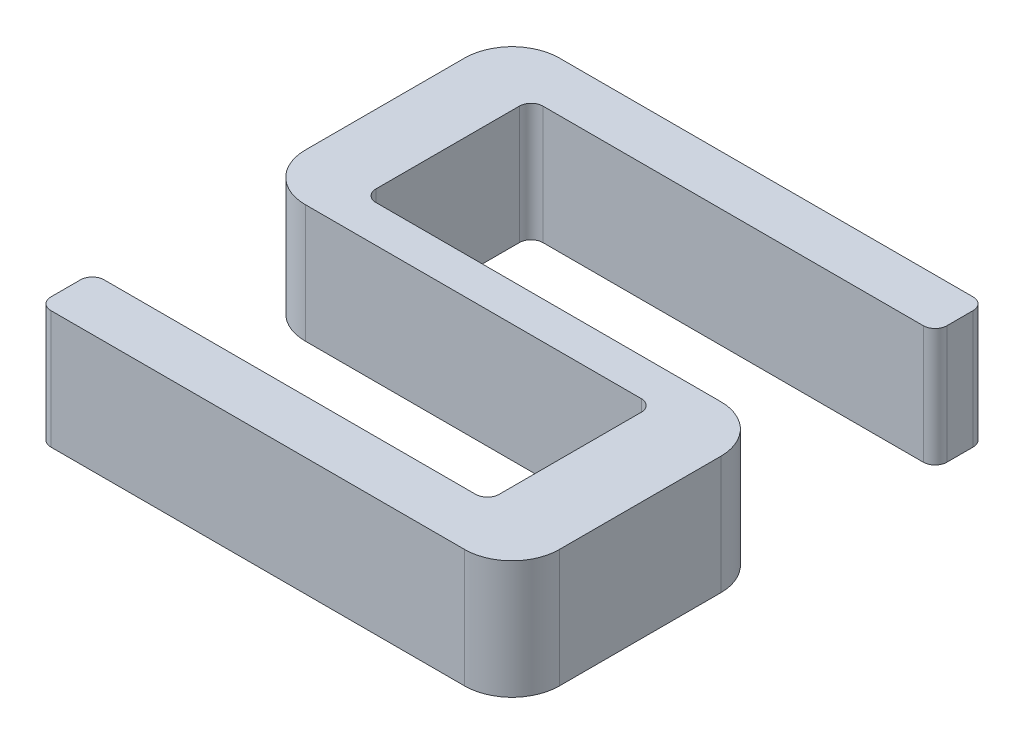
ISO-10303-21;
HEADER;
FILE_DESCRIPTION(('STEP AP214'),'2;1');
FILE_NAME('part.step','',(''),(''),'','','');
FILE_SCHEMA(('AUTOMOTIVE_DESIGN { 1 0 10303 214 1 1 1 1 }'));
ENDSEC;
DATA;
#1=APPLICATION_CONTEXT('core data for automotive mechanical design processes');
#2=APPLICATION_PROTOCOL_DEFINITION('international standard','automotive_design',2000,#1);
#3=PRODUCT_CONTEXT('',#1,'mechanical');
#4=PRODUCT('Part','Part','',(#3));
#5=PRODUCT_RELATED_PRODUCT_CATEGORY('part','',(#4));
#6=PRODUCT_DEFINITION_FORMATION('','',#4);
#7=PRODUCT_DEFINITION_CONTEXT('part definition',#1,'design');
#8=PRODUCT_DEFINITION('design','',#6,#7);
#9=PRODUCT_DEFINITION_SHAPE('','',#8);
#10=(LENGTH_UNIT() NAMED_UNIT(*) SI_UNIT(.MILLI.,.METRE.));
#11=(NAMED_UNIT(*) PLANE_ANGLE_UNIT() SI_UNIT($,.RADIAN.));
#12=(NAMED_UNIT(*) SI_UNIT($,.STERADIAN.) SOLID_ANGLE_UNIT());
#13=UNCERTAINTY_MEASURE_WITH_UNIT(LENGTH_MEASURE(1.E-05),#10,'distance_accuracy_value','');
#14=(GEOMETRIC_REPRESENTATION_CONTEXT(3) GLOBAL_UNCERTAINTY_ASSIGNED_CONTEXT((#13)) GLOBAL_UNIT_ASSIGNED_CONTEXT((#10,
#11,#12)) REPRESENTATION_CONTEXT('',''));
#15=CARTESIAN_POINT('',(0.,0.,0.));
#16=DIRECTION('',(0.,0.,1.));
#17=DIRECTION('',(1.,0.,0.));
#18=AXIS2_PLACEMENT_3D('',#15,#16,#17);
#19=CARTESIAN_POINT('',(33.4152682941176,10.,0.));
#20=DIRECTION('',(1.,0.,0.));
#21=DIRECTION('',(0.,0.,-1.));
#22=AXIS2_PLACEMENT_3D('',#19,#20,#21);
#23=PLANE('',#22);
#24=DIRECTION('',(0.,0.,1.));
#25=VECTOR('',#24,1.);
#26=CARTESIAN_POINT('',(33.4152682941176,0.,0.));
#27=LINE('',#26,#25);
#28=CARTESIAN_POINT('',(33.4152682941176,0.,-17.5184969509804));
#29=VERTEX_POINT('',#28);
#30=CARTESIAN_POINT('',(33.4152682941176,0.,-5.50410969607844));
#31=VERTEX_POINT('',#30);
#32=EDGE_CURVE('E455',#29,#31,#27,.T.);
#33=ORIENTED_EDGE('',*,*,#32,.T.);
#34=DIRECTION('',(0.,-1.,0.));
#35=VECTOR('',#34,1.);
#36=CARTESIAN_POINT('',(33.4152682941176,10.,-5.50410969607844));
#37=LINE('',#36,#35);
#38=CARTESIAN_POINT('',(33.4152682941176,10.,-5.50410969607844));
#39=VERTEX_POINT('',#38);
#40=EDGE_CURVE('E358',#31,#39,#37,.F.);
#41=ORIENTED_EDGE('',*,*,#40,.T.);
#42=DIRECTION('',(0.,0.,1.));
#43=VECTOR('',#42,1.);
#44=CARTESIAN_POINT('',(33.4152682941176,10.,0.));
#45=LINE('',#44,#43);
#46=CARTESIAN_POINT('',(33.4152682941176,10.,-17.5184969509804));
#47=VERTEX_POINT('',#46);
#48=EDGE_CURVE('E269',#47,#39,#45,.T.);
#49=ORIENTED_EDGE('',*,*,#48,.F.);
#50=DIRECTION('',(0.,-1.,0.));
#51=VECTOR('',#50,1.);
#52=CARTESIAN_POINT('',(33.4152682941176,0.,-17.5184969509804));
#53=LINE('',#52,#51);
#54=EDGE_CURVE('E354',#47,#29,#53,.T.);
#55=ORIENTED_EDGE('',*,*,#54,.T.);
#56=EDGE_LOOP('',(#33,#41,#49,#55));
#57=FACE_BOUND('',#56,.T.);
#58=ADVANCED_FACE('F43',(#57),#23,.F.);
#59=CARTESIAN_POINT('',(0.,10.,-4.50410969607844));
#60=DIRECTION('',(0.,0.,1.));
#61=DIRECTION('',(1.,0.,0.));
#62=AXIS2_PLACEMENT_3D('',#59,#60,#61);
#63=PLANE('',#62);
#64=DIRECTION('',(-1.,0.,0.));
#65=VECTOR('',#64,1.);
#66=CARTESIAN_POINT('',(0.,0.,-4.50410969607844));
#67=LINE('',#66,#65);
#68=CARTESIAN_POINT('',(32.4152682941176,0.,-4.50410969607844));
#69=VERTEX_POINT('',#68);
#70=CARTESIAN_POINT('',(1.,0.,-4.50410969607844));
#71=VERTEX_POINT('',#70);
#72=EDGE_CURVE('E459',#69,#71,#67,.T.);
#73=ORIENTED_EDGE('',*,*,#72,.T.);
#74=DIRECTION('',(0.,-1.,0.));
#75=VECTOR('',#74,1.);
#76=CARTESIAN_POINT('',(1.,10.,-4.50410969607844));
#77=LINE('',#76,#75);
#78=CARTESIAN_POINT('',(1.,10.,-4.50410969607844));
#79=VERTEX_POINT('',#78);
#80=EDGE_CURVE('E59',#71,#79,#77,.F.);
#81=ORIENTED_EDGE('',*,*,#80,.T.);
#82=DIRECTION('',(-1.,0.,0.));
#83=VECTOR('',#82,1.);
#84=CARTESIAN_POINT('',(0.,10.,-4.50410969607844));
#85=LINE('',#84,#83);
#86=CARTESIAN_POINT('',(32.4152682941176,10.,-4.50410969607844));
#87=VERTEX_POINT('',#86);
#88=EDGE_CURVE('E483',#87,#79,#85,.T.);
#89=ORIENTED_EDGE('',*,*,#88,.F.);
#90=DIRECTION('',(0.,-1.,0.));
#91=VECTOR('',#90,1.);
#92=CARTESIAN_POINT('',(32.4152682941176,0.,-4.50410969607844));
#93=LINE('',#92,#91);
#94=EDGE_CURVE('E348',#87,#69,#93,.T.);
#95=ORIENTED_EDGE('',*,*,#94,.T.);
#96=EDGE_LOOP('',(#73,#81,#89,#95));
#97=FACE_BOUND('',#96,.T.);
#98=ADVANCED_FACE('F497',(#97),#63,.F.);
#99=CARTESIAN_POINT('',(0.,10.,0.));
#100=DIRECTION('',(-1.,0.,0.));
#101=DIRECTION('',(0.,0.,1.));
#102=AXIS2_PLACEMENT_3D('',#99,#100,#101);
#103=PLANE('',#102);
#104=DIRECTION('',(0.,0.,-1.));
#105=VECTOR('',#104,1.);
#106=CARTESIAN_POINT('',(0.,0.,0.));
#107=LINE('',#106,#105);
#108=CARTESIAN_POINT('',(0.,0.,-1.));
#109=VERTEX_POINT('',#108);
#110=CARTESIAN_POINT('',(0.,0.,-3.50410969607844));
#111=VERTEX_POINT('',#110);
#112=EDGE_CURVE('E242',#109,#111,#107,.T.);
#113=ORIENTED_EDGE('',*,*,#112,.F.);
#114=DIRECTION('',(0.,-1.,0.));
#115=VECTOR('',#114,1.);
#116=CARTESIAN_POINT('',(0.,10.,-1.));
#117=LINE('',#116,#115);
#118=CARTESIAN_POINT('',(0.,10.,-1.));
#119=VERTEX_POINT('',#118);
#120=EDGE_CURVE('E333',#109,#119,#117,.F.);
#121=ORIENTED_EDGE('',*,*,#120,.T.);
#122=DIRECTION('',(0.,0.,-1.));
#123=VECTOR('',#122,1.);
#124=CARTESIAN_POINT('',(0.,10.,0.));
#125=LINE('',#124,#123);
#126=CARTESIAN_POINT('',(0.,10.,-3.50410969607844));
#127=VERTEX_POINT('',#126);
#128=EDGE_CURVE('E476',#119,#127,#125,.T.);
#129=ORIENTED_EDGE('',*,*,#128,.T.);
#130=DIRECTION('',(0.,-1.,0.));
#131=VECTOR('',#130,1.);
#132=CARTESIAN_POINT('',(0.,0.,-3.50410969607844));
#133=LINE('',#132,#131);
#134=EDGE_CURVE('E329',#127,#111,#133,.T.);
#135=ORIENTED_EDGE('',*,*,#134,.T.);
#136=EDGE_LOOP('',(#113,#121,#129,#135));
#137=FACE_BOUND('',#136,.T.);
#138=ADVANCED_FACE('F467',(#137),#103,.T.);
#139=CARTESIAN_POINT('',(0.,10.,0.));
#140=DIRECTION('',(0.,0.,-1.));
#141=DIRECTION('',(-1.,0.,0.));
#142=AXIS2_PLACEMENT_3D('',#139,#140,#141);
#143=PLANE('',#142);
#144=DIRECTION('',(1.,0.,0.));
#145=VECTOR('',#144,1.);
#146=CARTESIAN_POINT('',(0.,10.,0.));
#147=LINE('',#146,#145);
#148=CARTESIAN_POINT('',(1.,10.,0.));
#149=VERTEX_POINT('',#148);
#150=CARTESIAN_POINT('',(36.,10.,0.));
#151=VERTEX_POINT('',#150);
#152=EDGE_CURVE('E475',#149,#151,#147,.T.);
#153=ORIENTED_EDGE('',*,*,#152,.F.);
#154=DIRECTION('',(0.,-1.,0.));
#155=VECTOR('',#154,1.);
#156=CARTESIAN_POINT('',(1.,0.,0.));
#157=LINE('',#156,#155);
#158=CARTESIAN_POINT('',(1.,0.,0.));
#159=VERTEX_POINT('',#158);
#160=EDGE_CURVE('E313',#149,#159,#157,.T.);
#161=ORIENTED_EDGE('',*,*,#160,.T.);
#162=DIRECTION('',(1.,0.,0.));
#163=VECTOR('',#162,1.);
#164=CARTESIAN_POINT('',(0.,0.,0.));
#165=LINE('',#164,#163);
#166=CARTESIAN_POINT('',(36.,0.,0.));
#167=VERTEX_POINT('',#166);
#168=EDGE_CURVE('E236',#159,#167,#165,.T.);
#169=ORIENTED_EDGE('',*,*,#168,.T.);
#170=DIRECTION('',(0.,-1.,0.));
#171=VECTOR('',#170,1.);
#172=CARTESIAN_POINT('',(36.,10.,0.));
#173=LINE('',#172,#171);
#174=EDGE_CURVE('E213',#167,#151,#173,.F.);
#175=ORIENTED_EDGE('',*,*,#174,.T.);
#176=EDGE_LOOP('',(#153,#161,#169,#175));
#177=FACE_BOUND('',#176,.T.);
#178=ADVANCED_FACE('F478',(#177),#143,.F.);
#179=CARTESIAN_POINT('',(40.,10.,0.));
#180=DIRECTION('',(-1.,0.,0.));
#181=DIRECTION('',(0.,0.,1.));
#182=AXIS2_PLACEMENT_3D('',#179,#180,#181);
#183=PLANE('',#182);
#184=DIRECTION('',(0.,0.,-1.));
#185=VECTOR('',#184,1.);
#186=CARTESIAN_POINT('',(40.,10.,0.));
#187=LINE('',#186,#185);
#188=CARTESIAN_POINT('',(40.,10.,-4.));
#189=VERTEX_POINT('',#188);
#190=CARTESIAN_POINT('',(40.,10.,-17.6577196960784));
#191=VERTEX_POINT('',#190);
#192=EDGE_CURVE('E227',#189,#191,#187,.T.);
#193=ORIENTED_EDGE('',*,*,#192,.F.);
#194=DIRECTION('',(0.,-1.,0.));
#195=VECTOR('',#194,1.);
#196=CARTESIAN_POINT('',(40.,10.,-4.));
#197=LINE('',#196,#195);
#198=CARTESIAN_POINT('',(40.,0.,-4.));
#199=VERTEX_POINT('',#198);
#200=EDGE_CURVE('E211',#189,#199,#197,.T.);
#201=ORIENTED_EDGE('',*,*,#200,.T.);
#202=DIRECTION('',(0.,0.,-1.));
#203=VECTOR('',#202,1.);
#204=CARTESIAN_POINT('',(40.,0.,0.));
#205=LINE('',#204,#203);
#206=CARTESIAN_POINT('',(40.,0.,-17.6577196960784));
#207=VERTEX_POINT('',#206);
#208=EDGE_CURVE('E224',#199,#207,#205,.T.);
#209=ORIENTED_EDGE('',*,*,#208,.T.);
#210=DIRECTION('',(0.,-1.,0.));
#211=VECTOR('',#210,1.);
#212=CARTESIAN_POINT('',(40.,10.,-17.6577196960784));
#213=LINE('',#212,#211);
#214=EDGE_CURVE('E230',#207,#191,#213,.F.);
#215=ORIENTED_EDGE('',*,*,#214,.T.);
#216=EDGE_LOOP('',(#193,#201,#209,#215));
#217=FACE_BOUND('',#216,.T.);
#218=ADVANCED_FACE('F223',(#217),#183,.F.);
#219=CARTESIAN_POINT('',(0.,10.,-21.6577196960784));
#220=DIRECTION('',(0.,0.,-1.));
#221=DIRECTION('',(-1.,0.,0.));
#222=AXIS2_PLACEMENT_3D('',#219,#220,#221);
#223=PLANE('',#222);
#224=DIRECTION('',(1.,0.,0.));
#225=VECTOR('',#224,1.);
#226=CARTESIAN_POINT('',(0.,0.,-21.6577196960784));
#227=LINE('',#226,#225);
#228=CARTESIAN_POINT('',(6.83495417647059,0.,-21.6577196960784));
#229=VERTEX_POINT('',#228);
#230=CARTESIAN_POINT('',(36.,0.,-21.6577196960784));
#231=VERTEX_POINT('',#230);
#232=EDGE_CURVE('E235',#229,#231,#227,.T.);
#233=ORIENTED_EDGE('',*,*,#232,.F.);
#234=DIRECTION('',(0.,-1.,0.));
#235=VECTOR('',#234,1.);
#236=CARTESIAN_POINT('',(6.83495417647059,10.,-21.6577196960784));
#237=LINE('',#236,#235);
#238=CARTESIAN_POINT('',(6.83495417647059,10.,-21.6577196960784));
#239=VERTEX_POINT('',#238);
#240=EDGE_CURVE('E378',#229,#239,#237,.F.);
#241=ORIENTED_EDGE('',*,*,#240,.T.);
#242=DIRECTION('',(1.,0.,0.));
#243=VECTOR('',#242,1.);
#244=CARTESIAN_POINT('',(0.,10.,-21.6577196960784));
#245=LINE('',#244,#243);
#246=CARTESIAN_POINT('',(36.,10.,-21.6577196960784));
#247=VERTEX_POINT('',#246);
#248=EDGE_CURVE('E426',#239,#247,#245,.T.);
#249=ORIENTED_EDGE('',*,*,#248,.T.);
#250=DIRECTION('',(0.,-1.,0.));
#251=VECTOR('',#250,1.);
#252=CARTESIAN_POINT('',(36.,0.,-21.6577196960784));
#253=LINE('',#252,#251);
#254=EDGE_CURVE('E295',#247,#231,#253,.T.);
#255=ORIENTED_EDGE('',*,*,#254,.T.);
#256=EDGE_LOOP('',(#233,#241,#249,#255));
#257=FACE_BOUND('',#256,.T.);
#258=ADVANCED_FACE('F415',(#257),#223,.T.);
#259=CARTESIAN_POINT('',(5.83495417647059,10.,0.));
#260=DIRECTION('',(1.,0.,0.));
#261=DIRECTION('',(0.,0.,-1.));
#262=AXIS2_PLACEMENT_3D('',#259,#260,#261);
#263=PLANE('',#262);
#264=DIRECTION('',(0.,0.,1.));
#265=VECTOR('',#264,1.);
#266=CARTESIAN_POINT('',(5.83495417647059,0.,0.));
#267=LINE('',#266,#265);
#268=CARTESIAN_POINT('',(5.83495417647059,0.,-34.7842220490196));
#269=VERTEX_POINT('',#268);
#270=CARTESIAN_POINT('',(5.83495417647059,0.,-22.6577196960784));
#271=VERTEX_POINT('',#270);
#272=EDGE_CURVE('E240',#269,#271,#267,.T.);
#273=ORIENTED_EDGE('',*,*,#272,.F.);
#274=DIRECTION('',(0.,-1.,0.));
#275=VECTOR('',#274,1.);
#276=CARTESIAN_POINT('',(5.83495417647059,10.,-34.7842220490196));
#277=LINE('',#276,#275);
#278=CARTESIAN_POINT('',(5.83495417647059,10.,-34.7842220490196));
#279=VERTEX_POINT('',#278);
#280=EDGE_CURVE('E375',#269,#279,#277,.F.);
#281=ORIENTED_EDGE('',*,*,#280,.T.);
#282=DIRECTION('',(0.,0.,1.));
#283=VECTOR('',#282,1.);
#284=CARTESIAN_POINT('',(5.83495417647059,10.,0.));
#285=LINE('',#284,#283);
#286=CARTESIAN_POINT('',(5.83495417647059,10.,-22.6577196960784));
#287=VERTEX_POINT('',#286);
#288=EDGE_CURVE('E424',#279,#287,#285,.T.);
#289=ORIENTED_EDGE('',*,*,#288,.T.);
#290=DIRECTION('',(0.,-1.,0.));
#291=VECTOR('',#290,1.);
#292=CARTESIAN_POINT('',(5.83495417647059,0.,-22.6577196960784));
#293=LINE('',#292,#291);
#294=EDGE_CURVE('E371',#287,#271,#293,.T.);
#295=ORIENTED_EDGE('',*,*,#294,.T.);
#296=EDGE_LOOP('',(#273,#281,#289,#295));
#297=FACE_BOUND('',#296,.T.);
#298=ADVANCED_FACE('F428',(#297),#263,.T.);
#299=CARTESIAN_POINT('',(0.,10.,-35.7842220490196));
#300=DIRECTION('',(0.,0.,1.));
#301=DIRECTION('',(1.,0.,0.));
#302=AXIS2_PLACEMENT_3D('',#299,#300,#301);
#303=PLANE('',#302);
#304=DIRECTION('',(-1.,0.,0.));
#305=VECTOR('',#304,1.);
#306=CARTESIAN_POINT('',(0.,10.,-35.7842220490196));
#307=LINE('',#306,#305);
#308=CARTESIAN_POINT('',(39.,10.,-35.7842220490196));
#309=VERTEX_POINT('',#308);
#310=CARTESIAN_POINT('',(6.83495417647059,10.,-35.7842220490196));
#311=VERTEX_POINT('',#310);
#312=EDGE_CURVE('E431',#309,#311,#307,.T.);
#313=ORIENTED_EDGE('',*,*,#312,.T.);
#314=DIRECTION('',(0.,-1.,0.));
#315=VECTOR('',#314,1.);
#316=CARTESIAN_POINT('',(6.83495417647059,0.,-35.7842220490196));
#317=LINE('',#316,#315);
#318=CARTESIAN_POINT('',(6.83495417647059,0.,-35.7842220490196));
#319=VERTEX_POINT('',#318);
#320=EDGE_CURVE('E367',#311,#319,#317,.T.);
#321=ORIENTED_EDGE('',*,*,#320,.T.);
#322=DIRECTION('',(-1.,0.,0.));
#323=VECTOR('',#322,1.);
#324=CARTESIAN_POINT('',(0.,0.,-35.7842220490196));
#325=LINE('',#324,#323);
#326=CARTESIAN_POINT('',(39.,0.,-35.7842220490196));
#327=VERTEX_POINT('',#326);
#328=EDGE_CURVE('E249',#327,#319,#325,.T.);
#329=ORIENTED_EDGE('',*,*,#328,.F.);
#330=DIRECTION('',(0.,-1.,0.));
#331=VECTOR('',#330,1.);
#332=CARTESIAN_POINT('',(39.,10.,-35.7842220490196));
#333=LINE('',#332,#331);
#334=EDGE_CURVE('E364',#327,#309,#333,.F.);
#335=ORIENTED_EDGE('',*,*,#334,.T.);
#336=EDGE_LOOP('',(#313,#321,#329,#335));
#337=FACE_BOUND('',#336,.T.);
#338=ADVANCED_FACE('F539',(#337),#303,.T.);
#339=CARTESIAN_POINT('',(40.,10.,0.));
#340=DIRECTION('',(1.,0.,0.));
#341=DIRECTION('',(0.,0.,-1.));
#342=AXIS2_PLACEMENT_3D('',#339,#340,#341);
#343=PLANE('',#342);
#344=DIRECTION('',(0.,0.,1.));
#345=VECTOR('',#344,1.);
#346=CARTESIAN_POINT('',(40.,10.,0.));
#347=LINE('',#346,#345);
#348=CARTESIAN_POINT('',(40.,10.,-39.));
#349=VERTEX_POINT('',#348);
#350=CARTESIAN_POINT('',(40.,10.,-36.7842220490196));
#351=VERTEX_POINT('',#350);
#352=EDGE_CURVE('E436',#349,#351,#347,.T.);
#353=ORIENTED_EDGE('',*,*,#352,.T.);
#354=DIRECTION('',(0.,-1.,0.));
#355=VECTOR('',#354,1.);
#356=CARTESIAN_POINT('',(40.,10.,-36.7842220490196));
#357=LINE('',#356,#355);
#358=CARTESIAN_POINT('',(40.,0.,-36.7842220490196));
#359=VERTEX_POINT('',#358);
#360=EDGE_CURVE('E384',#351,#359,#357,.T.);
#361=ORIENTED_EDGE('',*,*,#360,.T.);
#362=DIRECTION('',(0.,0.,1.));
#363=VECTOR('',#362,1.);
#364=CARTESIAN_POINT('',(40.,0.,0.));
#365=LINE('',#364,#363);
#366=CARTESIAN_POINT('',(40.,0.,-39.));
#367=VERTEX_POINT('',#366);
#368=EDGE_CURVE('E253',#367,#359,#365,.T.);
#369=ORIENTED_EDGE('',*,*,#368,.F.);
#370=DIRECTION('',(0.,-1.,0.));
#371=VECTOR('',#370,1.);
#372=CARTESIAN_POINT('',(40.,10.,-39.));
#373=LINE('',#372,#371);
#374=EDGE_CURVE('E381',#367,#349,#373,.F.);
#375=ORIENTED_EDGE('',*,*,#374,.T.);
#376=EDGE_LOOP('',(#353,#361,#369,#375));
#377=FACE_BOUND('',#376,.T.);
#378=ADVANCED_FACE('F530',(#377),#343,.T.);
#379=CARTESIAN_POINT('',(0.,10.,-40.));
#380=DIRECTION('',(0.,0.,-1.));
#381=DIRECTION('',(-1.,0.,0.));
#382=AXIS2_PLACEMENT_3D('',#379,#380,#381);
#383=PLANE('',#382);
#384=DIRECTION('',(1.,0.,0.));
#385=VECTOR('',#384,1.);
#386=CARTESIAN_POINT('',(0.,10.,-40.));
#387=LINE('',#386,#385);
#388=CARTESIAN_POINT('',(4.,10.,-40.));
#389=VERTEX_POINT('',#388);
#390=CARTESIAN_POINT('',(39.,10.,-40.));
#391=VERTEX_POINT('',#390);
#392=EDGE_CURVE('E444',#389,#391,#387,.T.);
#393=ORIENTED_EDGE('',*,*,#392,.T.);
#394=DIRECTION('',(0.,-1.,0.));
#395=VECTOR('',#394,1.);
#396=CARTESIAN_POINT('',(39.,10.,-40.));
#397=LINE('',#396,#395);
#398=CARTESIAN_POINT('',(39.,0.,-40.));
#399=VERTEX_POINT('',#398);
#400=EDGE_CURVE('E388',#391,#399,#397,.T.);
#401=ORIENTED_EDGE('',*,*,#400,.T.);
#402=DIRECTION('',(1.,0.,0.));
#403=VECTOR('',#402,1.);
#404=CARTESIAN_POINT('',(0.,0.,-40.));
#405=LINE('',#404,#403);
#406=CARTESIAN_POINT('',(4.,0.,-40.));
#407=VERTEX_POINT('',#406);
#408=EDGE_CURVE('E257',#407,#399,#405,.T.);
#409=ORIENTED_EDGE('',*,*,#408,.F.);
#410=DIRECTION('',(0.,-1.,0.));
#411=VECTOR('',#410,1.);
#412=CARTESIAN_POINT('',(4.,10.,-40.));
#413=LINE('',#412,#411);
#414=EDGE_CURVE('E310',#407,#389,#413,.F.);
#415=ORIENTED_EDGE('',*,*,#414,.T.);
#416=EDGE_LOOP('',(#393,#401,#409,#415));
#417=FACE_BOUND('',#416,.T.);
#418=ADVANCED_FACE('F522',(#417),#383,.T.);
#419=CARTESIAN_POINT('',(0.,10.,0.));
#420=DIRECTION('',(1.,0.,0.));
#421=DIRECTION('',(0.,0.,-1.));
#422=AXIS2_PLACEMENT_3D('',#419,#420,#421);
#423=PLANE('',#422);
#424=DIRECTION('',(0.,0.,1.));
#425=VECTOR('',#424,1.);
#426=CARTESIAN_POINT('',(0.,0.,0.));
#427=LINE('',#426,#425);
#428=CARTESIAN_POINT('',(0.,0.,-36.));
#429=VERTEX_POINT('',#428);
#430=CARTESIAN_POINT('',(0.,0.,-22.5184969509804));
#431=VERTEX_POINT('',#430);
#432=EDGE_CURVE('E261',#429,#431,#427,.T.);
#433=ORIENTED_EDGE('',*,*,#432,.T.);
#434=DIRECTION('',(0.,-1.,0.));
#435=VECTOR('',#434,1.);
#436=CARTESIAN_POINT('',(0.,10.,-22.5184969509804));
#437=LINE('',#436,#435);
#438=CARTESIAN_POINT('',(0.,10.,-22.5184969509804));
#439=VERTEX_POINT('',#438);
#440=EDGE_CURVE('E307',#431,#439,#437,.F.);
#441=ORIENTED_EDGE('',*,*,#440,.T.);
#442=DIRECTION('',(0.,0.,1.));
#443=VECTOR('',#442,1.);
#444=CARTESIAN_POINT('',(0.,10.,0.));
#445=LINE('',#444,#443);
#446=CARTESIAN_POINT('',(0.,10.,-36.));
#447=VERTEX_POINT('',#446);
#448=EDGE_CURVE('E448',#447,#439,#445,.T.);
#449=ORIENTED_EDGE('',*,*,#448,.F.);
#450=DIRECTION('',(0.,-1.,0.));
#451=VECTOR('',#450,1.);
#452=CARTESIAN_POINT('',(0.,0.,-36.));
#453=LINE('',#452,#451);
#454=EDGE_CURVE('E303',#447,#429,#453,.T.);
#455=ORIENTED_EDGE('',*,*,#454,.T.);
#456=EDGE_LOOP('',(#433,#441,#449,#455));
#457=FACE_BOUND('',#456,.T.);
#458=ADVANCED_FACE('F513',(#457),#423,.F.);
#459=CARTESIAN_POINT('',(0.,10.,-18.5184969509804));
#460=DIRECTION('',(0.,0.,-1.));
#461=DIRECTION('',(-1.,0.,0.));
#462=AXIS2_PLACEMENT_3D('',#459,#460,#461);
#463=PLANE('',#462);
#464=DIRECTION('',(1.,0.,0.));
#465=VECTOR('',#464,1.);
#466=CARTESIAN_POINT('',(0.,0.,-18.5184969509804));
#467=LINE('',#466,#465);
#468=CARTESIAN_POINT('',(4.,0.,-18.5184969509804));
#469=VERTEX_POINT('',#468);
#470=CARTESIAN_POINT('',(32.4152682941176,0.,-18.5184969509804));
#471=VERTEX_POINT('',#470);
#472=EDGE_CURVE('E265',#469,#471,#467,.T.);
#473=ORIENTED_EDGE('',*,*,#472,.T.);
#474=DIRECTION('',(0.,-1.,0.));
#475=VECTOR('',#474,1.);
#476=CARTESIAN_POINT('',(32.4152682941176,10.,-18.5184969509804));
#477=LINE('',#476,#475);
#478=CARTESIAN_POINT('',(32.4152682941176,10.,-18.5184969509804));
#479=VERTEX_POINT('',#478);
#480=EDGE_CURVE('E361',#471,#479,#477,.F.);
#481=ORIENTED_EDGE('',*,*,#480,.T.);
#482=DIRECTION('',(1.,0.,0.));
#483=VECTOR('',#482,1.);
#484=CARTESIAN_POINT('',(0.,10.,-18.5184969509804));
#485=LINE('',#484,#483);
#486=CARTESIAN_POINT('',(4.,10.,-18.5184969509804));
#487=VERTEX_POINT('',#486);
#488=EDGE_CURVE('E271',#487,#479,#485,.T.);
#489=ORIENTED_EDGE('',*,*,#488,.F.);
#490=DIRECTION('',(0.,-1.,0.));
#491=VECTOR('',#490,1.);
#492=CARTESIAN_POINT('',(4.,10.,-18.5184969509804));
#493=LINE('',#492,#491);
#494=EDGE_CURVE('E299',#487,#469,#493,.T.);
#495=ORIENTED_EDGE('',*,*,#494,.T.);
#496=EDGE_LOOP('',(#473,#481,#489,#495));
#497=FACE_BOUND('',#496,.T.);
#498=ADVANCED_FACE('F504',(#497),#463,.F.);
#499=CARTESIAN_POINT('',(0.,10.,0.));
#500=DIRECTION('',(0.,1.,0.));
#501=DIRECTION('',(0.,0.,1.));
#502=AXIS2_PLACEMENT_3D('',#499,#500,#501);
#503=PLANE('',#502);
#504=ORIENTED_EDGE('',*,*,#128,.F.);
#505=CARTESIAN_POINT('',(1.,10.,-1.));
#506=DIRECTION('',(0.,1.,0.));
#507=DIRECTION('',(0.,0.,1.));
#508=AXIS2_PLACEMENT_3D('',#505,#506,#507);
#509=CIRCLE('',#508,1.);
#510=EDGE_CURVE('E345',#119,#149,#509,.T.);
#511=ORIENTED_EDGE('',*,*,#510,.T.);
#512=ORIENTED_EDGE('',*,*,#152,.T.);
#513=CARTESIAN_POINT('',(36.,10.,-4.));
#514=DIRECTION('',(0.,1.,0.));
#515=DIRECTION('',(0.,0.,1.));
#516=AXIS2_PLACEMENT_3D('',#513,#514,#515);
#517=CIRCLE('',#516,4.);
#518=EDGE_CURVE('E292',#151,#189,#517,.T.);
#519=ORIENTED_EDGE('',*,*,#518,.T.);
#520=ORIENTED_EDGE('',*,*,#192,.T.);
#521=CARTESIAN_POINT('',(36.,10.,-17.6577196960784));
#522=DIRECTION('',(0.,1.,0.));
#523=DIRECTION('',(0.,0.,1.));
#524=AXIS2_PLACEMENT_3D('',#521,#522,#523);
#525=CIRCLE('',#524,4.);
#526=EDGE_CURVE('E288',#191,#247,#525,.T.);
#527=ORIENTED_EDGE('',*,*,#526,.T.);
#528=ORIENTED_EDGE('',*,*,#248,.F.);
#529=CARTESIAN_POINT('',(6.83495417647059,10.,-22.6577196960784));
#530=DIRECTION('',(0.,1.,0.));
#531=DIRECTION('',(0.,0.,1.));
#532=AXIS2_PLACEMENT_3D('',#529,#530,#531);
#533=CIRCLE('',#532,1.);
#534=EDGE_CURVE('E11',#239,#287,#533,.F.);
#535=ORIENTED_EDGE('',*,*,#534,.T.);
#536=ORIENTED_EDGE('',*,*,#288,.F.);
#537=CARTESIAN_POINT('',(6.83495417647059,10.,-34.7842220490196));
#538=DIRECTION('',(0.,1.,0.));
#539=DIRECTION('',(0.,0.,1.));
#540=AXIS2_PLACEMENT_3D('',#537,#538,#539);
#541=CIRCLE('',#540,1.);
#542=EDGE_CURVE('E406',#279,#311,#541,.F.);
#543=ORIENTED_EDGE('',*,*,#542,.T.);
#544=ORIENTED_EDGE('',*,*,#312,.F.);
#545=CARTESIAN_POINT('',(39.,10.,-36.7842220490196));
#546=DIRECTION('',(0.,1.,0.));
#547=DIRECTION('',(0.,0.,1.));
#548=AXIS2_PLACEMENT_3D('',#545,#546,#547);
#549=CIRCLE('',#548,1.);
#550=EDGE_CURVE('E339',#309,#351,#549,.T.);
#551=ORIENTED_EDGE('',*,*,#550,.T.);
#552=ORIENTED_EDGE('',*,*,#352,.F.);
#553=CARTESIAN_POINT('',(39.,10.,-39.));
#554=DIRECTION('',(0.,1.,0.));
#555=DIRECTION('',(0.,0.,1.));
#556=AXIS2_PLACEMENT_3D('',#553,#554,#555);
#557=CIRCLE('',#556,1.);
#558=EDGE_CURVE('E336',#349,#391,#557,.T.);
#559=ORIENTED_EDGE('',*,*,#558,.T.);
#560=ORIENTED_EDGE('',*,*,#392,.F.);
#561=CARTESIAN_POINT('',(4.,10.,-36.));
#562=DIRECTION('',(0.,1.,0.));
#563=DIRECTION('',(0.,0.,1.));
#564=AXIS2_PLACEMENT_3D('',#561,#562,#563);
#565=CIRCLE('',#564,4.);
#566=EDGE_CURVE('E282',#389,#447,#565,.T.);
#567=ORIENTED_EDGE('',*,*,#566,.T.);
#568=ORIENTED_EDGE('',*,*,#448,.T.);
#569=CARTESIAN_POINT('',(4.,10.,-22.5184969509804));
#570=DIRECTION('',(0.,1.,0.));
#571=DIRECTION('',(0.,0.,1.));
#572=AXIS2_PLACEMENT_3D('',#569,#570,#571);
#573=CIRCLE('',#572,4.);
#574=EDGE_CURVE('E285',#439,#487,#573,.T.);
#575=ORIENTED_EDGE('',*,*,#574,.T.);
#576=ORIENTED_EDGE('',*,*,#488,.T.);
#577=CARTESIAN_POINT('',(32.4152682941176,10.,-17.5184969509804));
#578=DIRECTION('',(0.,1.,0.));
#579=DIRECTION('',(0.,0.,1.));
#580=AXIS2_PLACEMENT_3D('',#577,#578,#579);
#581=CIRCLE('',#580,1.);
#582=EDGE_CURVE('E400',#479,#47,#581,.F.);
#583=ORIENTED_EDGE('',*,*,#582,.T.);
#584=ORIENTED_EDGE('',*,*,#48,.T.);
#585=CARTESIAN_POINT('',(32.4152682941176,10.,-5.50410969607844));
#586=DIRECTION('',(0.,1.,0.));
#587=DIRECTION('',(0.,0.,1.));
#588=AXIS2_PLACEMENT_3D('',#585,#586,#587);
#589=CIRCLE('',#588,1.);
#590=EDGE_CURVE('E66',#39,#87,#589,.F.);
#591=ORIENTED_EDGE('',*,*,#590,.T.);
#592=ORIENTED_EDGE('',*,*,#88,.T.);
#593=CARTESIAN_POINT('',(1.,10.,-3.50410969607844));
#594=DIRECTION('',(0.,1.,0.));
#595=DIRECTION('',(0.,0.,1.));
#596=AXIS2_PLACEMENT_3D('',#593,#594,#595);
#597=CIRCLE('',#596,1.);
#598=EDGE_CURVE('E342',#79,#127,#597,.T.);
#599=ORIENTED_EDGE('',*,*,#598,.T.);
#600=EDGE_LOOP('',(#504,#511,#512,#519,#520,#527,#528,#535,#536,#543,#544,#551,#552,#559,#560,
#567,#568,#575,#576,#583,#584,#591,#592,#599));
#601=FACE_BOUND('',#600,.T.);
#602=ADVANCED_FACE('F423',(#601),#503,.T.);
#603=CARTESIAN_POINT('',(0.,0.,0.));
#604=DIRECTION('',(0.,1.,0.));
#605=DIRECTION('',(0.,0.,1.));
#606=AXIS2_PLACEMENT_3D('',#603,#604,#605);
#607=PLANE('',#606);
#608=ORIENTED_EDGE('',*,*,#168,.F.);
#609=CARTESIAN_POINT('',(1.,0.,-1.));
#610=DIRECTION('',(0.,1.,0.));
#611=DIRECTION('',(0.,0.,1.));
#612=AXIS2_PLACEMENT_3D('',#609,#610,#611);
#613=CIRCLE('',#612,1.);
#614=EDGE_CURVE('E326',#159,#109,#613,.F.);
#615=ORIENTED_EDGE('',*,*,#614,.T.);
#616=ORIENTED_EDGE('',*,*,#112,.T.);
#617=CARTESIAN_POINT('',(1.,0.,-3.50410969607844));
#618=DIRECTION('',(0.,1.,0.));
#619=DIRECTION('',(0.,0.,1.));
#620=AXIS2_PLACEMENT_3D('',#617,#618,#619);
#621=CIRCLE('',#620,1.);
#622=EDGE_CURVE('E323',#111,#71,#621,.F.);
#623=ORIENTED_EDGE('',*,*,#622,.T.);
#624=ORIENTED_EDGE('',*,*,#72,.F.);
#625=CARTESIAN_POINT('',(32.4152682941176,0.,-5.50410969607844));
#626=DIRECTION('',(0.,1.,0.));
#627=DIRECTION('',(0.,0.,1.));
#628=AXIS2_PLACEMENT_3D('',#625,#626,#627);
#629=CIRCLE('',#628,1.);
#630=EDGE_CURVE('E392',#69,#31,#629,.T.);
#631=ORIENTED_EDGE('',*,*,#630,.T.);
#632=ORIENTED_EDGE('',*,*,#32,.F.);
#633=CARTESIAN_POINT('',(32.4152682941176,0.,-17.5184969509804));
#634=DIRECTION('',(0.,1.,0.));
#635=DIRECTION('',(0.,0.,1.));
#636=AXIS2_PLACEMENT_3D('',#633,#634,#635);
#637=CIRCLE('',#636,1.);
#638=EDGE_CURVE('E397',#29,#471,#637,.T.);
#639=ORIENTED_EDGE('',*,*,#638,.T.);
#640=ORIENTED_EDGE('',*,*,#472,.F.);
#641=CARTESIAN_POINT('',(4.,0.,-22.5184969509804));
#642=DIRECTION('',(0.,1.,0.));
#643=DIRECTION('',(0.,0.,1.));
#644=AXIS2_PLACEMENT_3D('',#641,#642,#643);
#645=CIRCLE('',#644,4.);
#646=EDGE_CURVE('E275',#469,#431,#645,.F.);
#647=ORIENTED_EDGE('',*,*,#646,.T.);
#648=ORIENTED_EDGE('',*,*,#432,.F.);
#649=CARTESIAN_POINT('',(4.,0.,-36.));
#650=DIRECTION('',(0.,1.,0.));
#651=DIRECTION('',(0.,0.,1.));
#652=AXIS2_PLACEMENT_3D('',#649,#650,#651);
#653=CIRCLE('',#652,4.);
#654=EDGE_CURVE('E229',#429,#407,#653,.F.);
#655=ORIENTED_EDGE('',*,*,#654,.T.);
#656=ORIENTED_EDGE('',*,*,#408,.T.);
#657=CARTESIAN_POINT('',(39.,0.,-39.));
#658=DIRECTION('',(0.,1.,0.));
#659=DIRECTION('',(0.,0.,1.));
#660=AXIS2_PLACEMENT_3D('',#657,#658,#659);
#661=CIRCLE('',#660,1.);
#662=EDGE_CURVE('E317',#399,#367,#661,.F.);
#663=ORIENTED_EDGE('',*,*,#662,.T.);
#664=ORIENTED_EDGE('',*,*,#368,.T.);
#665=CARTESIAN_POINT('',(39.,0.,-36.7842220490196));
#666=DIRECTION('',(0.,1.,0.));
#667=DIRECTION('',(0.,0.,1.));
#668=AXIS2_PLACEMENT_3D('',#665,#666,#667);
#669=CIRCLE('',#668,1.);
#670=EDGE_CURVE('E320',#359,#327,#669,.F.);
#671=ORIENTED_EDGE('',*,*,#670,.T.);
#672=ORIENTED_EDGE('',*,*,#328,.T.);
#673=CARTESIAN_POINT('',(6.83495417647059,0.,-34.7842220490196));
#674=DIRECTION('',(0.,1.,0.));
#675=DIRECTION('',(0.,0.,1.));
#676=AXIS2_PLACEMENT_3D('',#673,#674,#675);
#677=CIRCLE('',#676,1.);
#678=EDGE_CURVE('E403',#319,#269,#677,.T.);
#679=ORIENTED_EDGE('',*,*,#678,.T.);
#680=ORIENTED_EDGE('',*,*,#272,.T.);
#681=CARTESIAN_POINT('',(6.83495417647059,0.,-22.6577196960784));
#682=DIRECTION('',(0.,1.,0.));
#683=DIRECTION('',(0.,0.,1.));
#684=AXIS2_PLACEMENT_3D('',#681,#682,#683);
#685=CIRCLE('',#684,1.);
#686=EDGE_CURVE('E52',#271,#229,#685,.T.);
#687=ORIENTED_EDGE('',*,*,#686,.T.);
#688=ORIENTED_EDGE('',*,*,#232,.T.);
#689=CARTESIAN_POINT('',(36.,0.,-17.6577196960784));
#690=DIRECTION('',(0.,1.,0.));
#691=DIRECTION('',(0.,0.,1.));
#692=AXIS2_PLACEMENT_3D('',#689,#690,#691);
#693=CIRCLE('',#692,4.);
#694=EDGE_CURVE('E218',#231,#207,#693,.F.);
#695=ORIENTED_EDGE('',*,*,#694,.T.);
#696=ORIENTED_EDGE('',*,*,#208,.F.);
#697=CARTESIAN_POINT('',(36.,0.,-4.));
#698=DIRECTION('',(0.,1.,0.));
#699=DIRECTION('',(0.,0.,1.));
#700=AXIS2_PLACEMENT_3D('',#697,#698,#699);
#701=CIRCLE('',#700,4.);
#702=EDGE_CURVE('E207',#199,#167,#701,.F.);
#703=ORIENTED_EDGE('',*,*,#702,.T.);
#704=EDGE_LOOP('',(#608,#615,#616,#623,#624,#631,#632,#639,#640,#647,#648,#655,#656,#663,#664,
#671,#672,#679,#680,#687,#688,#695,#696,#703));
#705=FACE_BOUND('',#704,.T.);
#706=ADVANCED_FACE('F232',(#705),#607,.F.);
#707=CARTESIAN_POINT('',(36.,10.,-4.));
#708=DIRECTION('',(0.,-1.,0.));
#709=DIRECTION('',(0.,0.,-1.));
#710=AXIS2_PLACEMENT_3D('',#707,#708,#709);
#711=CYLINDRICAL_SURFACE('',#710,4.);
#712=ORIENTED_EDGE('',*,*,#518,.F.);
#713=ORIENTED_EDGE('',*,*,#174,.F.);
#714=ORIENTED_EDGE('',*,*,#702,.F.);
#715=ORIENTED_EDGE('',*,*,#200,.F.);
#716=EDGE_LOOP('',(#712,#713,#714,#715));
#717=FACE_BOUND('',#716,.T.);
#718=ADVANCED_FACE('F210',(#717),#711,.T.);
#719=CARTESIAN_POINT('',(36.,10.,-17.6577196960784));
#720=DIRECTION('',(0.,1.,0.));
#721=DIRECTION('',(0.,0.,1.));
#722=AXIS2_PLACEMENT_3D('',#719,#720,#721);
#723=CYLINDRICAL_SURFACE('',#722,4.);
#724=ORIENTED_EDGE('',*,*,#526,.F.);
#725=ORIENTED_EDGE('',*,*,#214,.F.);
#726=ORIENTED_EDGE('',*,*,#694,.F.);
#727=ORIENTED_EDGE('',*,*,#254,.F.);
#728=EDGE_LOOP('',(#724,#725,#726,#727));
#729=FACE_BOUND('',#728,.T.);
#730=ADVANCED_FACE('F562',(#729),#723,.T.);
#731=CARTESIAN_POINT('',(4.,10.,-22.5184969509804));
#732=DIRECTION('',(0.,-1.,0.));
#733=DIRECTION('',(0.,0.,-1.));
#734=AXIS2_PLACEMENT_3D('',#731,#732,#733);
#735=CYLINDRICAL_SURFACE('',#734,4.);
#736=ORIENTED_EDGE('',*,*,#574,.F.);
#737=ORIENTED_EDGE('',*,*,#440,.F.);
#738=ORIENTED_EDGE('',*,*,#646,.F.);
#739=ORIENTED_EDGE('',*,*,#494,.F.);
#740=EDGE_LOOP('',(#736,#737,#738,#739));
#741=FACE_BOUND('',#740,.T.);
#742=ADVANCED_FACE('F509',(#741),#735,.T.);
#743=CARTESIAN_POINT('',(4.,10.,-36.));
#744=DIRECTION('',(0.,1.,0.));
#745=DIRECTION('',(0.,0.,1.));
#746=AXIS2_PLACEMENT_3D('',#743,#744,#745);
#747=CYLINDRICAL_SURFACE('',#746,4.);
#748=ORIENTED_EDGE('',*,*,#566,.F.);
#749=ORIENTED_EDGE('',*,*,#414,.F.);
#750=ORIENTED_EDGE('',*,*,#654,.F.);
#751=ORIENTED_EDGE('',*,*,#454,.F.);
#752=EDGE_LOOP('',(#748,#749,#750,#751));
#753=FACE_BOUND('',#752,.T.);
#754=ADVANCED_FACE('F518',(#753),#747,.T.);
#755=CARTESIAN_POINT('',(1.,10.,-1.));
#756=DIRECTION('',(0.,1.,0.));
#757=DIRECTION('',(0.,0.,1.));
#758=AXIS2_PLACEMENT_3D('',#755,#756,#757);
#759=CYLINDRICAL_SURFACE('',#758,1.);
#760=ORIENTED_EDGE('',*,*,#510,.F.);
#761=ORIENTED_EDGE('',*,*,#120,.F.);
#762=ORIENTED_EDGE('',*,*,#614,.F.);
#763=ORIENTED_EDGE('',*,*,#160,.F.);
#764=EDGE_LOOP('',(#760,#761,#762,#763));
#765=FACE_BOUND('',#764,.T.);
#766=ADVANCED_FACE('F472',(#765),#759,.T.);
#767=CARTESIAN_POINT('',(1.,10.,-3.50410969607844));
#768=DIRECTION('',(0.,1.,0.));
#769=DIRECTION('',(0.,0.,1.));
#770=AXIS2_PLACEMENT_3D('',#767,#768,#769);
#771=CYLINDRICAL_SURFACE('',#770,1.);
#772=ORIENTED_EDGE('',*,*,#598,.F.);
#773=ORIENTED_EDGE('',*,*,#80,.F.);
#774=ORIENTED_EDGE('',*,*,#622,.F.);
#775=ORIENTED_EDGE('',*,*,#134,.F.);
#776=EDGE_LOOP('',(#772,#773,#774,#775));
#777=FACE_BOUND('',#776,.T.);
#778=ADVANCED_FACE('F572',(#777),#771,.T.);
#779=CARTESIAN_POINT('',(32.4152682941176,10.,-5.50410969607844));
#780=DIRECTION('',(0.,1.,0.));
#781=DIRECTION('',(0.,0.,1.));
#782=AXIS2_PLACEMENT_3D('',#779,#780,#781);
#783=CYLINDRICAL_SURFACE('',#782,1.);
#784=ORIENTED_EDGE('',*,*,#590,.F.);
#785=ORIENTED_EDGE('',*,*,#40,.F.);
#786=ORIENTED_EDGE('',*,*,#630,.F.);
#787=ORIENTED_EDGE('',*,*,#94,.F.);
#788=EDGE_LOOP('',(#784,#785,#786,#787));
#789=FACE_BOUND('',#788,.T.);
#790=ADVANCED_FACE('F496',(#789),#783,.F.);
#791=CARTESIAN_POINT('',(32.4152682941176,10.,-17.5184969509804));
#792=DIRECTION('',(0.,1.,0.));
#793=DIRECTION('',(0.,0.,1.));
#794=AXIS2_PLACEMENT_3D('',#791,#792,#793);
#795=CYLINDRICAL_SURFACE('',#794,1.);
#796=ORIENTED_EDGE('',*,*,#582,.F.);
#797=ORIENTED_EDGE('',*,*,#480,.F.);
#798=ORIENTED_EDGE('',*,*,#638,.F.);
#799=ORIENTED_EDGE('',*,*,#54,.F.);
#800=EDGE_LOOP('',(#796,#797,#798,#799));
#801=FACE_BOUND('',#800,.T.);
#802=ADVANCED_FACE('F500',(#801),#795,.F.);
#803=CARTESIAN_POINT('',(6.83495417647059,10.,-34.7842220490196));
#804=DIRECTION('',(0.,1.,0.));
#805=DIRECTION('',(0.,0.,1.));
#806=AXIS2_PLACEMENT_3D('',#803,#804,#805);
#807=CYLINDRICAL_SURFACE('',#806,1.);
#808=ORIENTED_EDGE('',*,*,#542,.F.);
#809=ORIENTED_EDGE('',*,*,#280,.F.);
#810=ORIENTED_EDGE('',*,*,#678,.F.);
#811=ORIENTED_EDGE('',*,*,#320,.F.);
#812=EDGE_LOOP('',(#808,#809,#810,#811));
#813=FACE_BOUND('',#812,.T.);
#814=ADVANCED_FACE('F543',(#813),#807,.F.);
#815=CARTESIAN_POINT('',(6.83495417647059,10.,-22.6577196960784));
#816=DIRECTION('',(0.,1.,0.));
#817=DIRECTION('',(0.,0.,1.));
#818=AXIS2_PLACEMENT_3D('',#815,#816,#817);
#819=CYLINDRICAL_SURFACE('',#818,1.);
#820=ORIENTED_EDGE('',*,*,#534,.F.);
#821=ORIENTED_EDGE('',*,*,#240,.F.);
#822=ORIENTED_EDGE('',*,*,#686,.F.);
#823=ORIENTED_EDGE('',*,*,#294,.F.);
#824=EDGE_LOOP('',(#820,#821,#822,#823));
#825=FACE_BOUND('',#824,.T.);
#826=ADVANCED_FACE('F419',(#825),#819,.F.);
#827=CARTESIAN_POINT('',(39.,10.,-36.7842220490196));
#828=DIRECTION('',(0.,-1.,0.));
#829=DIRECTION('',(0.,0.,-1.));
#830=AXIS2_PLACEMENT_3D('',#827,#828,#829);
#831=CYLINDRICAL_SURFACE('',#830,1.);
#832=ORIENTED_EDGE('',*,*,#550,.F.);
#833=ORIENTED_EDGE('',*,*,#334,.F.);
#834=ORIENTED_EDGE('',*,*,#670,.F.);
#835=ORIENTED_EDGE('',*,*,#360,.F.);
#836=EDGE_LOOP('',(#832,#833,#834,#835));
#837=FACE_BOUND('',#836,.T.);
#838=ADVANCED_FACE('F535',(#837),#831,.T.);
#839=CARTESIAN_POINT('',(39.,10.,-39.));
#840=DIRECTION('',(0.,-1.,0.));
#841=DIRECTION('',(0.,0.,-1.));
#842=AXIS2_PLACEMENT_3D('',#839,#840,#841);
#843=CYLINDRICAL_SURFACE('',#842,1.);
#844=ORIENTED_EDGE('',*,*,#558,.F.);
#845=ORIENTED_EDGE('',*,*,#374,.F.);
#846=ORIENTED_EDGE('',*,*,#662,.F.);
#847=ORIENTED_EDGE('',*,*,#400,.F.);
#848=EDGE_LOOP('',(#844,#845,#846,#847));
#849=FACE_BOUND('',#848,.T.);
#850=ADVANCED_FACE('F45',(#849),#843,.T.);
#851=CLOSED_SHELL('',(#58,#98,#138,#178,#218,#258,#298,#338,#378,#418,#458,#498,#602,#706,#718,
#730,#742,#754,#766,#778,#790,#802,#814,#826,#838,#850));
#852=MANIFOLD_SOLID_BREP('B2',#851);
#853=ADVANCED_BREP_SHAPE_REPRESENTATION('',(#18,#852),#14);
#854=SHAPE_DEFINITION_REPRESENTATION(#9,#853);
ENDSEC;
END-ISO-10303-21;
